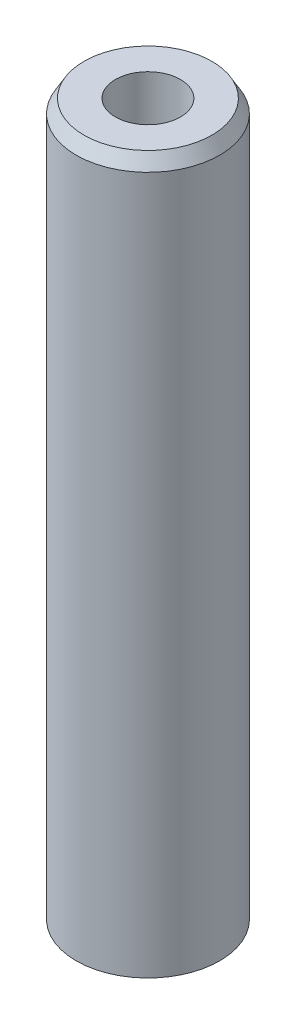
ISO-10303-21;
HEADER;
FILE_DESCRIPTION(('STEP AP214'),'2;1');
FILE_NAME('part.step','',(''),(''),'','','');
FILE_SCHEMA(('AUTOMOTIVE_DESIGN { 1 0 10303 214 1 1 1 1 }'));
ENDSEC;
DATA;
#1=APPLICATION_CONTEXT('core data for automotive mechanical design processes');
#2=APPLICATION_PROTOCOL_DEFINITION('international standard','automotive_design',2000,#1);
#3=PRODUCT_CONTEXT('',#1,'mechanical');
#4=PRODUCT('Part','Part','',(#3));
#5=PRODUCT_RELATED_PRODUCT_CATEGORY('part','',(#4));
#6=PRODUCT_DEFINITION_FORMATION('','',#4);
#7=PRODUCT_DEFINITION_CONTEXT('part definition',#1,'design');
#8=PRODUCT_DEFINITION('design','',#6,#7);
#9=PRODUCT_DEFINITION_SHAPE('','',#8);
#10=(LENGTH_UNIT() NAMED_UNIT(*) SI_UNIT(.MILLI.,.METRE.));
#11=(NAMED_UNIT(*) PLANE_ANGLE_UNIT() SI_UNIT($,.RADIAN.));
#12=(NAMED_UNIT(*) SI_UNIT($,.STERADIAN.) SOLID_ANGLE_UNIT());
#13=UNCERTAINTY_MEASURE_WITH_UNIT(LENGTH_MEASURE(1.E-05),#10,'distance_accuracy_value','');
#14=(GEOMETRIC_REPRESENTATION_CONTEXT(3) GLOBAL_UNCERTAINTY_ASSIGNED_CONTEXT((#13)) GLOBAL_UNIT_ASSIGNED_CONTEXT((#10,
#11,#12)) REPRESENTATION_CONTEXT('',''));
#15=CARTESIAN_POINT('',(0.,0.,0.));
#16=DIRECTION('',(0.,0.,1.));
#17=DIRECTION('',(1.,0.,0.));
#18=AXIS2_PLACEMENT_3D('',#15,#16,#17);
#19=CARTESIAN_POINT('',(0.,50.1019864374435,0.));
#20=DIRECTION('',(0.,-1.,0.));
#21=DIRECTION('',(0.,0.,-1.));
#22=AXIS2_PLACEMENT_3D('',#19,#20,#21);
#23=CYLINDRICAL_SURFACE('',#22,5.);
#24=CARTESIAN_POINT('',(0.,49.1639037772511,0.));
#25=DIRECTION('',(0.,1.,0.));
#26=DIRECTION('',(0.,0.,1.));
#27=AXIS2_PLACEMENT_3D('',#24,#25,#26);
#28=CIRCLE('',#27,5.);
#29=CARTESIAN_POINT('',(0.,49.1639037772511,5.));
#30=VERTEX_POINT('',#29);
#31=EDGE_CURVE('E50',#30,#30,#28,.F.);
#32=ORIENTED_EDGE('',*,*,#31,.T.);
#33=EDGE_LOOP('',(#32));
#34=FACE_BOUND('',#33,.T.);
#35=CARTESIAN_POINT('',(0.,0.541602276384182,0.));
#36=DIRECTION('',(0.,1.,0.));
#37=DIRECTION('',(0.,0.,1.));
#38=AXIS2_PLACEMENT_3D('',#35,#36,#37);
#39=CIRCLE('',#38,5.);
#40=CARTESIAN_POINT('',(0.,0.541602276384181,5.));
#41=VERTEX_POINT('',#40);
#42=EDGE_CURVE('E51',#41,#41,#39,.T.);
#43=ORIENTED_EDGE('',*,*,#42,.T.);
#44=EDGE_LOOP('',(#43));
#45=FACE_BOUND('',#44,.T.);
#46=ADVANCED_FACE('F39',(#34,#45),#23,.T.);
#47=CARTESIAN_POINT('',(0.,50.1019864374435,0.));
#48=DIRECTION('',(0.,1.,0.));
#49=DIRECTION('',(0.,0.,1.));
#50=AXIS2_PLACEMENT_3D('',#47,#48,#49);
#51=PLANE('',#50);
#52=CARTESIAN_POINT('',(0.,50.1019864374435,0.));
#53=DIRECTION('',(0.,1.,0.));
#54=DIRECTION('',(0.,0.,1.));
#55=AXIS2_PLACEMENT_3D('',#52,#53,#54);
#56=CIRCLE('',#55,4.45839772361582);
#57=CARTESIAN_POINT('',(0.,50.1019864374435,4.45839772361582));
#58=VERTEX_POINT('',#57);
#59=EDGE_CURVE('E54',#58,#58,#56,.T.);
#60=ORIENTED_EDGE('',*,*,#59,.T.);
#61=EDGE_LOOP('',(#60));
#62=FACE_BOUND('',#61,.T.);
#63=CARTESIAN_POINT('',(0.,50.1019864374435,0.));
#64=DIRECTION('',(0.,1.,0.));
#65=DIRECTION('',(0.,0.,1.));
#66=AXIS2_PLACEMENT_3D('',#63,#64,#65);
#67=CIRCLE('',#66,2.26607247578462);
#68=CARTESIAN_POINT('',(0.,50.1019864374435,2.26607247578462));
#69=VERTEX_POINT('',#68);
#70=EDGE_CURVE('E58',#69,#69,#67,.T.);
#71=ORIENTED_EDGE('',*,*,#70,.F.);
#72=EDGE_LOOP('',(#71));
#73=FACE_BOUND('',#72,.T.);
#74=ADVANCED_FACE('F69',(#62,#73),#51,.T.);
#75=CARTESIAN_POINT('',(0.,0.,0.));
#76=DIRECTION('',(0.,1.,0.));
#77=DIRECTION('',(0.,0.,1.));
#78=AXIS2_PLACEMENT_3D('',#75,#76,#77);
#79=PLANE('',#78);
#80=CARTESIAN_POINT('',(0.,0.,0.));
#81=DIRECTION('',(0.,1.,0.));
#82=DIRECTION('',(0.,0.,1.));
#83=AXIS2_PLACEMENT_3D('',#80,#81,#82);
#84=CIRCLE('',#83,4.06191733980763);
#85=CARTESIAN_POINT('',(0.,0.,4.06191733980763));
#86=VERTEX_POINT('',#85);
#87=EDGE_CURVE('E10',#86,#86,#84,.F.);
#88=ORIENTED_EDGE('',*,*,#87,.T.);
#89=EDGE_LOOP('',(#88));
#90=FACE_BOUND('',#89,.T.);
#91=CARTESIAN_POINT('',(0.,0.,0.));
#92=DIRECTION('',(0.,1.,0.));
#93=DIRECTION('',(0.,0.,1.));
#94=AXIS2_PLACEMENT_3D('',#91,#92,#93);
#95=CIRCLE('',#94,2.26607247578462);
#96=CARTESIAN_POINT('',(0.,0.,2.26607247578462));
#97=VERTEX_POINT('',#96);
#98=EDGE_CURVE('E63',#97,#97,#95,.T.);
#99=ORIENTED_EDGE('',*,*,#98,.T.);
#100=EDGE_LOOP('',(#99));
#101=FACE_BOUND('',#100,.T.);
#102=ADVANCED_FACE('F75',(#90,#101),#79,.F.);
#103=CARTESIAN_POINT('',(0.,50.1019864374435,0.));
#104=DIRECTION('',(0.,-1.,0.));
#105=DIRECTION('',(0.,0.,-1.));
#106=AXIS2_PLACEMENT_3D('',#103,#104,#105);
#107=CYLINDRICAL_SURFACE('',#106,2.26607247578462);
#108=ORIENTED_EDGE('',*,*,#70,.T.);
#109=EDGE_LOOP('',(#108));
#110=FACE_BOUND('',#109,.T.);
#111=ORIENTED_EDGE('',*,*,#98,.F.);
#112=EDGE_LOOP('',(#111));
#113=FACE_BOUND('',#112,.T.);
#114=ADVANCED_FACE('F70',(#110,#113),#107,.F.);
#115=CARTESIAN_POINT('',(0.,50.1019864374435,0.));
#116=DIRECTION('',(0.,-1.,0.));
#117=DIRECTION('',(0.,0.,-1.));
#118=AXIS2_PLACEMENT_3D('',#115,#116,#117);
#119=CONICAL_SURFACE('',#118,4.45839772361582,0.523598775598294);
#120=ORIENTED_EDGE('',*,*,#31,.F.);
#121=EDGE_LOOP('',(#120));
#122=FACE_BOUND('',#121,.T.);
#123=ORIENTED_EDGE('',*,*,#59,.F.);
#124=EDGE_LOOP('',(#123));
#125=FACE_BOUND('',#124,.T.);
#126=ADVANCED_FACE('F81',(#122,#125),#119,.T.);
#127=CARTESIAN_POINT('',(0.,0.541602276384182,0.));
#128=DIRECTION('',(0.,1.,0.));
#129=DIRECTION('',(0.,0.,1.));
#130=AXIS2_PLACEMENT_3D('',#127,#128,#129);
#131=CONICAL_SURFACE('',#130,5.,1.0471975511966);
#132=CARTESIAN_POINT('',(0.,0.,4.06191733980763));
#133=CARTESIAN_POINT('',(0.,0.00564169037900199,4.07168903418463));
#134=CARTESIAN_POINT('',(0.,0.0112833807580038,4.08146072856164));
#135=CARTESIAN_POINT('',(0.,0.0225667615160074,4.10100411731565));
#136=CARTESIAN_POINT('',(0.,0.0282084518950093,4.11077581169265));
#137=CARTESIAN_POINT('',(0.,0.0394918326530131,4.13031920044666));
#138=CARTESIAN_POINT('',(0.,0.0451335230320151,4.14009089482366));
#139=CARTESIAN_POINT('',(0.,0.0564169037900188,4.15963428357767));
#140=CARTESIAN_POINT('',(0.,0.0620585941690206,4.16940597795467));
#141=CARTESIAN_POINT('',(0.,0.0733419749270244,4.18894936670868));
#142=CARTESIAN_POINT('',(0.,0.0789836653060264,4.19872106108568));
#143=CARTESIAN_POINT('',(0.,0.0902670460640302,4.21826444983969));
#144=CARTESIAN_POINT('',(0.,0.095908736443032,4.2280361442167));
#145=CARTESIAN_POINT('',(0.,0.107192117201036,4.2475795329707));
#146=CARTESIAN_POINT('',(0.,0.112833807580038,4.25735122734771));
#147=CARTESIAN_POINT('',(0.,0.124117188338041,4.27689461610172));
#148=CARTESIAN_POINT('',(0.,0.129758878717043,4.28666631047872));
#149=CARTESIAN_POINT('',(0.,0.141042259475047,4.30620969923273));
#150=CARTESIAN_POINT('',(0.,0.146683949854049,4.31598139360973));
#151=CARTESIAN_POINT('',(0.,0.157967330612053,4.33552478236374));
#152=CARTESIAN_POINT('',(0.,0.163609020991055,4.34529647674074));
#153=CARTESIAN_POINT('',(0.,0.174892401749058,4.36483986549475));
#154=CARTESIAN_POINT('',(0.,0.18053409212806,4.37461155987175));
#155=CARTESIAN_POINT('',(0.,0.191817472886064,4.39415494862576));
#156=CARTESIAN_POINT('',(0.,0.197459163265066,4.40392664300277));
#157=CARTESIAN_POINT('',(0.,0.20874254402307,4.42347003175677));
#158=CARTESIAN_POINT('',(0.,0.214384234402072,4.43324172613378));
#159=CARTESIAN_POINT('',(0.,0.225667615160076,4.45278511488779));
#160=CARTESIAN_POINT('',(0.,0.231309305539077,4.46255680926479));
#161=CARTESIAN_POINT('',(0.,0.242592686297081,4.4821001980188));
#162=CARTESIAN_POINT('',(0.,0.248234376676083,4.4918718923958));
#163=CARTESIAN_POINT('',(0.,0.259517757434087,4.51141528114981));
#164=CARTESIAN_POINT('',(0.,0.265159447813089,4.52118697552681));
#165=CARTESIAN_POINT('',(0.,0.276442828571093,4.54073036428082));
#166=CARTESIAN_POINT('',(0.,0.282084518950094,4.55050205865782));
#167=CARTESIAN_POINT('',(0.,0.293367899708098,4.57004544741183));
#168=CARTESIAN_POINT('',(0.,0.2990095900871,4.57981714178884));
#169=CARTESIAN_POINT('',(0.,0.310292970845104,4.59936053054284));
#170=CARTESIAN_POINT('',(0.,0.315934661224106,4.60913222491985));
#171=CARTESIAN_POINT('',(0.,0.32721804198211,4.62867561367385));
#172=CARTESIAN_POINT('',(0.,0.332859732361111,4.63844730805086));
#173=CARTESIAN_POINT('',(0.,0.344143113119115,4.65799069680487));
#174=CARTESIAN_POINT('',(0.,0.349784803498117,4.66776239118187));
#175=CARTESIAN_POINT('',(0.,0.361068184256121,4.68730577993588));
#176=CARTESIAN_POINT('',(0.,0.366709874635123,4.69707747431288));
#177=CARTESIAN_POINT('',(0.,0.377993255393127,4.71662086306689));
#178=CARTESIAN_POINT('',(0.,0.383634945772129,4.72639255744389));
#179=CARTESIAN_POINT('',(0.,0.394918326530132,4.7459359461979));
#180=CARTESIAN_POINT('',(0.,0.400560016909134,4.7557076405749));
#181=CARTESIAN_POINT('',(0.,0.411843397667138,4.77525102932891));
#182=CARTESIAN_POINT('',(0.,0.41748508804614,4.78502272370592));
#183=CARTESIAN_POINT('',(0.,0.428768468804144,4.80456611245992));
#184=CARTESIAN_POINT('',(0.,0.434410159183146,4.81433780683693));
#185=CARTESIAN_POINT('',(0.,0.445693539941149,4.83388119559094));
#186=CARTESIAN_POINT('',(0.,0.451335230320151,4.84365288996794));
#187=CARTESIAN_POINT('',(0.,0.462618611078155,4.86319627872195));
#188=CARTESIAN_POINT('',(0.,0.468260301457157,4.87296797309895));
#189=CARTESIAN_POINT('',(0.,0.479543682215161,4.89251136185296));
#190=CARTESIAN_POINT('',(0.,0.485185372594163,4.90228305622996));
#191=CARTESIAN_POINT('',(0.,0.496468753352166,4.92182644498397));
#192=CARTESIAN_POINT('',(0.,0.502110443731168,4.93159813936097));
#193=CARTESIAN_POINT('',(0.,0.513393824489172,4.95114152811498));
#194=CARTESIAN_POINT('',(0.,0.519035514868174,4.96091322249198));
#195=CARTESIAN_POINT('',(0.,0.530318895626178,4.98045661124599));
#196=CARTESIAN_POINT('',(0.,0.53596058600518,4.990228305623));
#197=CARTESIAN_POINT('',(0.,0.541602276384181,5.));
#198=B_SPLINE_CURVE_WITH_KNOTS('',3,(#132,#133,#134,#135,#136,#137,#138,#139,#140,#141,#142,
#143,#144,#145,#146,#147,#148,#149,#150,#151,#152,#153,#154,#155,#156,#157,#158,#159,#160,#161,
#162,#163,#164,#165,#166,#167,#168,#169,#170,#171,#172,#173,#174,#175,#176,#177,#178,#179,#180,
#181,#182,#183,#184,#185,#186,#187,#188,#189,#190,#191,#192,#193,#194,#195,#196,#197),
.UNSPECIFIED.,.F.,.F.,(4,2,2,2,2,2,2,2,2,2,2,2,2,2,2,2,2,2,2,2,2,2,2,2,2,2,2,2,2,2,2,2,4),(0.,
0.033850142274011,0.0677002845480228,0.101550426822034,0.135400569096046,0.169250711370057,
0.203100853644068,0.23695099591808,0.270801138192091,0.304651280466103,0.338501422740115,
0.372351565014126,0.406201707288138,0.440051849562149,0.47390199183616,0.507752134110172,
0.541602276384183,0.575452418658195,0.609302560932206,0.643152703206218,0.67700284548023,
0.710852987754241,0.744703130028252,0.778553272302263,0.812403414576275,0.846253556850287,
0.880103699124298,0.91395384139831,0.947803983672321,0.981654125946333,1.01550426822034,
1.04935441049436,1.08320455276837),.UNSPECIFIED.);
#199=EDGE_CURVE('BSEAM45',#86,#41,#198,.T.);
#200=ORIENTED_EDGE('',*,*,#87,.F.);
#201=ORIENTED_EDGE('',*,*,#42,.F.);
#202=ORIENTED_EDGE('',*,*,#199,.T.);
#203=ORIENTED_EDGE('',*,*,#199,.F.);
#204=EDGE_LOOP('',(#200,#202,#201,#203));
#205=FACE_BOUND('',#204,.T.);
#206=ADVANCED_FACE('F45',(#205),#131,.T.);
#207=CLOSED_SHELL('',(#46,#74,#102,#114,#126,#206));
#208=MANIFOLD_SOLID_BREP('B2',#207);
#209=ADVANCED_BREP_SHAPE_REPRESENTATION('',(#18,#208),#14);
#210=SHAPE_DEFINITION_REPRESENTATION(#9,#209);
ENDSEC;
END-ISO-10303-21;
